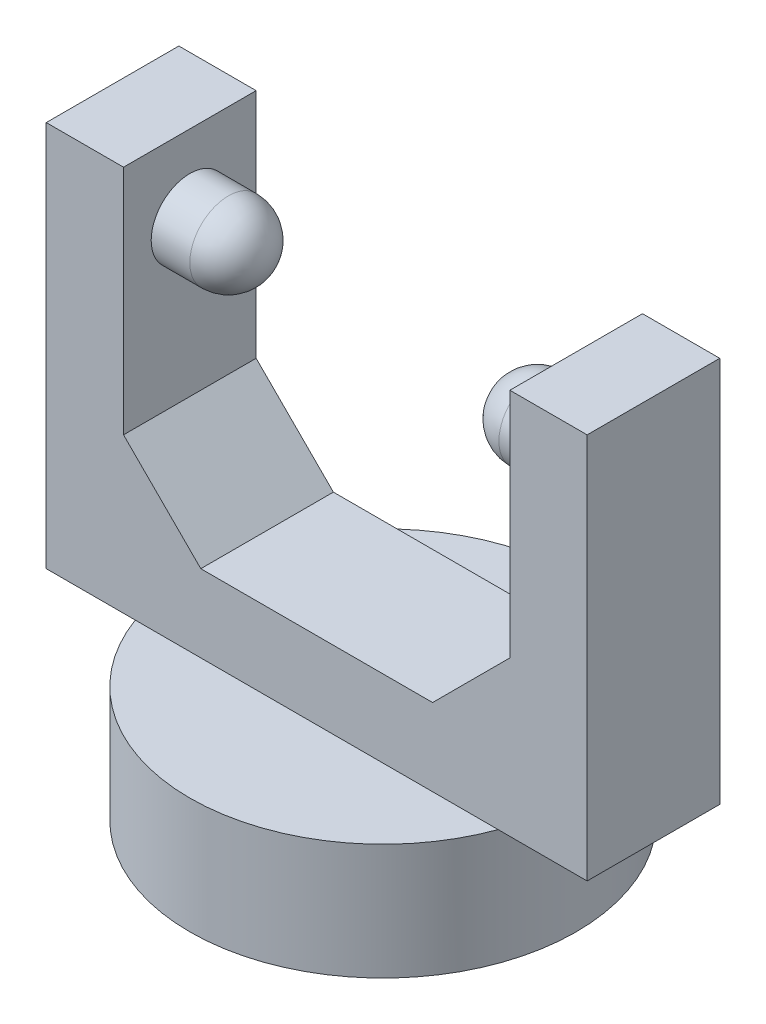
ISO-10303-21;
HEADER;
FILE_DESCRIPTION(('STEP AP214'),'2;1');
FILE_NAME('part.step','',(''),(''),'','','');
FILE_SCHEMA(('AUTOMOTIVE_DESIGN { 1 0 10303 214 1 1 1 1 }'));
ENDSEC;
DATA;
#1=APPLICATION_CONTEXT('core data for automotive mechanical design processes');
#2=APPLICATION_PROTOCOL_DEFINITION('international standard','automotive_design',2000,#1);
#3=PRODUCT_CONTEXT('',#1,'mechanical');
#4=PRODUCT('Part','Part','',(#3));
#5=PRODUCT_RELATED_PRODUCT_CATEGORY('part','',(#4));
#6=PRODUCT_DEFINITION_FORMATION('','',#4);
#7=PRODUCT_DEFINITION_CONTEXT('part definition',#1,'design');
#8=PRODUCT_DEFINITION('design','',#6,#7);
#9=PRODUCT_DEFINITION_SHAPE('','',#8);
#10=(LENGTH_UNIT() NAMED_UNIT(*) SI_UNIT(.MILLI.,.METRE.));
#11=(NAMED_UNIT(*) PLANE_ANGLE_UNIT() SI_UNIT($,.RADIAN.));
#12=(NAMED_UNIT(*) SI_UNIT($,.STERADIAN.) SOLID_ANGLE_UNIT());
#13=UNCERTAINTY_MEASURE_WITH_UNIT(LENGTH_MEASURE(1.E-05),#10,'distance_accuracy_value','');
#14=(GEOMETRIC_REPRESENTATION_CONTEXT(3) GLOBAL_UNCERTAINTY_ASSIGNED_CONTEXT((#13)) GLOBAL_UNIT_ASSIGNED_CONTEXT((#10,
#11,#12)) REPRESENTATION_CONTEXT('',''));
#15=CARTESIAN_POINT('',(0.,0.,0.));
#16=DIRECTION('',(0.,0.,1.));
#17=DIRECTION('',(1.,0.,0.));
#18=AXIS2_PLACEMENT_3D('',#15,#16,#17);
#19=CARTESIAN_POINT('',(0.,32.5,0.));
#20=DIRECTION('',(0.,1.,0.));
#21=DIRECTION('',(0.,0.,1.));
#22=AXIS2_PLACEMENT_3D('',#19,#20,#21);
#23=PLANE('',#22);
#24=DIRECTION('',(0.,0.,1.));
#25=VECTOR('',#24,1.);
#26=CARTESIAN_POINT('',(-12.5,32.5,-4.29038395748194));
#27=LINE('',#26,#25);
#28=CARTESIAN_POINT('',(-12.5,32.5,-4.29038395748194));
#29=VERTEX_POINT('',#28);
#30=CARTESIAN_POINT('',(-12.5,32.5,4.29038395748193));
#31=VERTEX_POINT('',#30);
#32=EDGE_CURVE('E143',#29,#31,#27,.T.);
#33=ORIENTED_EDGE('',*,*,#32,.F.);
#34=DIRECTION('',(-1.,0.,0.));
#35=VECTOR('',#34,1.);
#36=CARTESIAN_POINT('',(-17.5,32.5,-4.29038395748194));
#37=LINE('',#36,#35);
#38=CARTESIAN_POINT('',(-17.5,32.5,-4.29038395748194));
#39=VERTEX_POINT('',#38);
#40=EDGE_CURVE('E161',#29,#39,#37,.T.);
#41=ORIENTED_EDGE('',*,*,#40,.T.);
#42=DIRECTION('',(0.,0.,1.));
#43=VECTOR('',#42,1.);
#44=CARTESIAN_POINT('',(-17.5,32.5,-4.29038395748194));
#45=LINE('',#44,#43);
#46=CARTESIAN_POINT('',(-17.5,32.5,4.29038395748193));
#47=VERTEX_POINT('',#46);
#48=EDGE_CURVE('E153',#39,#47,#45,.T.);
#49=ORIENTED_EDGE('',*,*,#48,.T.);
#50=DIRECTION('',(1.,0.,0.));
#51=VECTOR('',#50,1.);
#52=CARTESIAN_POINT('',(-17.5,32.5,4.29038395748193));
#53=LINE('',#52,#51);
#54=EDGE_CURVE('E133',#47,#31,#53,.T.);
#55=ORIENTED_EDGE('',*,*,#54,.T.);
#56=EDGE_LOOP('',(#33,#41,#49,#55));
#57=FACE_BOUND('',#56,.T.);
#58=ADVANCED_FACE('F38',(#57),#23,.T.);
#59=CARTESIAN_POINT('',(0.,7.5,0.));
#60=DIRECTION('',(0.,1.,0.));
#61=DIRECTION('',(0.,0.,1.));
#62=AXIS2_PLACEMENT_3D('',#59,#60,#61);
#63=PLANE('',#62);
#64=DIRECTION('',(-1.,0.,0.));
#65=VECTOR('',#64,1.);
#66=CARTESIAN_POINT('',(-17.5,7.5,-4.29038395748194));
#67=LINE('',#66,#65);
#68=CARTESIAN_POINT('',(11.7406390583044,7.5,-4.29038395748194));
#69=VERTEX_POINT('',#68);
#70=CARTESIAN_POINT('',(-11.7406390583044,7.5,-4.29038395748194));
#71=VERTEX_POINT('',#70);
#72=EDGE_CURVE('E188',#69,#71,#67,.T.);
#73=ORIENTED_EDGE('',*,*,#72,.F.);
#74=CARTESIAN_POINT('',(0.,7.5,0.));
#75=DIRECTION('',(0.,1.,0.));
#76=DIRECTION('',(0.,0.,1.));
#77=AXIS2_PLACEMENT_3D('',#74,#75,#76);
#78=CIRCLE('',#77,12.5);
#79=EDGE_CURVE('E208',#69,#71,#78,.T.);
#80=ORIENTED_EDGE('',*,*,#79,.T.);
#81=EDGE_LOOP('',(#73,#80));
#82=FACE_BOUND('',#81,.T.);
#83=ADVANCED_FACE('F263',(#82),#63,.T.);
#84=CARTESIAN_POINT('',(0.,7.5,0.));
#85=DIRECTION('',(0.,-1.,0.));
#86=DIRECTION('',(0.,0.,-1.));
#87=AXIS2_PLACEMENT_3D('',#84,#85,#86);
#88=CYLINDRICAL_SURFACE('',#87,12.5);
#89=CARTESIAN_POINT('',(11.7406390583043,7.5,4.29038395748194));
#90=VERTEX_POINT('',#89);
#91=EDGE_CURVE('E204',#90,#69,#78,.T.);
#92=ORIENTED_EDGE('',*,*,#91,.F.);
#93=CARTESIAN_POINT('',(-11.7406390583044,7.5,4.29038395748193));
#94=VERTEX_POINT('',#93);
#95=EDGE_CURVE('E209',#94,#90,#78,.T.);
#96=ORIENTED_EDGE('',*,*,#95,.F.);
#97=EDGE_CURVE('E325',#71,#94,#78,.T.);
#98=ORIENTED_EDGE('',*,*,#97,.F.);
#99=ORIENTED_EDGE('',*,*,#79,.F.);
#100=EDGE_LOOP('',(#92,#96,#98,#99));
#101=FACE_BOUND('',#100,.T.);
#102=CARTESIAN_POINT('',(0.,0.,0.));
#103=DIRECTION('',(0.,1.,0.));
#104=DIRECTION('',(0.,0.,1.));
#105=AXIS2_PLACEMENT_3D('',#102,#103,#104);
#106=CIRCLE('',#105,12.5);
#107=CARTESIAN_POINT('',(0.,0.,12.5));
#108=VERTEX_POINT('',#107);
#109=EDGE_CURVE('E203',#108,#108,#106,.T.);
#110=ORIENTED_EDGE('',*,*,#109,.T.);
#111=EDGE_LOOP('',(#110));
#112=FACE_BOUND('',#111,.T.);
#113=ADVANCED_FACE('F269',(#101,#112),#88,.T.);
#114=DIRECTION('',(1.,0.,0.));
#115=VECTOR('',#114,1.);
#116=CARTESIAN_POINT('',(-17.5,7.5,4.29038395748193));
#117=LINE('',#116,#115);
#118=EDGE_CURVE('E180',#94,#90,#117,.T.);
#119=ORIENTED_EDGE('',*,*,#118,.F.);
#120=ORIENTED_EDGE('',*,*,#95,.T.);
#121=EDGE_LOOP('',(#119,#120));
#122=FACE_BOUND('',#121,.T.);
#123=ADVANCED_FACE('F272',(#122),#63,.T.);
#124=CARTESIAN_POINT('',(0.,0.,0.));
#125=DIRECTION('',(0.,1.,0.));
#126=DIRECTION('',(0.,0.,1.));
#127=AXIS2_PLACEMENT_3D('',#124,#125,#126);
#128=PLANE('',#127);
#129=ORIENTED_EDGE('',*,*,#109,.F.);
#130=EDGE_LOOP('',(#129));
#131=FACE_BOUND('',#130,.T.);
#132=ADVANCED_FACE('F348',(#131),#128,.F.);
#133=CARTESIAN_POINT('',(0.,7.5,0.));
#134=DIRECTION('',(0.,1.,0.));
#135=DIRECTION('',(0.,0.,1.));
#136=AXIS2_PLACEMENT_3D('',#133,#134,#135);
#137=PLANE('',#136);
#138=CARTESIAN_POINT('',(17.5,7.5,4.29038395748194));
#139=VERTEX_POINT('',#138);
#140=EDGE_CURVE('E174',#90,#139,#117,.T.);
#141=ORIENTED_EDGE('',*,*,#140,.F.);
#142=ORIENTED_EDGE('',*,*,#91,.T.);
#143=CARTESIAN_POINT('',(17.5,7.5,-4.29038395748194));
#144=VERTEX_POINT('',#143);
#145=EDGE_CURVE('E184',#144,#69,#67,.T.);
#146=ORIENTED_EDGE('',*,*,#145,.F.);
#147=DIRECTION('',(0.,0.,-1.));
#148=VECTOR('',#147,1.);
#149=CARTESIAN_POINT('',(17.5,7.5,-4.29038395748194));
#150=LINE('',#149,#148);
#151=EDGE_CURVE('E179',#139,#144,#150,.T.);
#152=ORIENTED_EDGE('',*,*,#151,.F.);
#153=EDGE_LOOP('',(#141,#142,#146,#152));
#154=FACE_BOUND('',#153,.T.);
#155=ADVANCED_FACE('F345',(#154),#137,.F.);
#156=CARTESIAN_POINT('',(-17.5,7.5,-4.29038395748194));
#157=VERTEX_POINT('',#156);
#158=EDGE_CURVE('E183',#71,#157,#67,.T.);
#159=ORIENTED_EDGE('',*,*,#158,.F.);
#160=ORIENTED_EDGE('',*,*,#97,.T.);
#161=CARTESIAN_POINT('',(-17.5,7.5,4.29038395748193));
#162=VERTEX_POINT('',#161);
#163=EDGE_CURVE('E175',#162,#94,#117,.T.);
#164=ORIENTED_EDGE('',*,*,#163,.F.);
#165=DIRECTION('',(0.,0.,1.));
#166=VECTOR('',#165,1.);
#167=CARTESIAN_POINT('',(-17.5,7.5,-4.29038395748194));
#168=LINE('',#167,#166);
#169=EDGE_CURVE('E170',#157,#162,#168,.T.);
#170=ORIENTED_EDGE('',*,*,#169,.F.);
#171=EDGE_LOOP('',(#159,#160,#164,#170));
#172=FACE_BOUND('',#171,.T.);
#173=ADVANCED_FACE('F338',(#172),#137,.F.);
#174=CARTESIAN_POINT('',(-17.5,32.5,-4.29038395748194));
#175=DIRECTION('',(1.,0.,0.));
#176=DIRECTION('',(0.,0.,-1.));
#177=AXIS2_PLACEMENT_3D('',#174,#175,#176);
#178=PLANE('',#177);
#179=ORIENTED_EDGE('',*,*,#169,.T.);
#180=DIRECTION('',(0.,-1.,0.));
#181=VECTOR('',#180,1.);
#182=CARTESIAN_POINT('',(-17.5,32.5,4.29038395748193));
#183=LINE('',#182,#181);
#184=EDGE_CURVE('E200',#47,#162,#183,.T.);
#185=ORIENTED_EDGE('',*,*,#184,.F.);
#186=ORIENTED_EDGE('',*,*,#48,.F.);
#187=DIRECTION('',(0.,-1.,0.));
#188=VECTOR('',#187,1.);
#189=CARTESIAN_POINT('',(-17.5,32.5,-4.29038395748194));
#190=LINE('',#189,#188);
#191=EDGE_CURVE('E169',#39,#157,#190,.T.);
#192=ORIENTED_EDGE('',*,*,#191,.T.);
#193=EDGE_LOOP('',(#179,#185,#186,#192));
#194=FACE_BOUND('',#193,.T.);
#195=ADVANCED_FACE('F337',(#194),#178,.F.);
#196=CARTESIAN_POINT('',(-17.5,32.5,4.29038395748193));
#197=DIRECTION('',(0.,0.,-1.));
#198=DIRECTION('',(-1.,0.,0.));
#199=AXIS2_PLACEMENT_3D('',#196,#197,#198);
#200=PLANE('',#199);
#201=DIRECTION('',(1.,0.,0.));
#202=VECTOR('',#201,1.);
#203=CARTESIAN_POINT('',(-12.5,12.5,4.29038395748193));
#204=LINE('',#203,#202);
#205=CARTESIAN_POINT('',(-7.49999999999997,12.5,4.29038395748193));
#206=VERTEX_POINT('',#205);
#207=CARTESIAN_POINT('',(7.49999999999997,12.5,4.29038395748193));
#208=VERTEX_POINT('',#207);
#209=EDGE_CURVE('E292',#206,#208,#204,.T.);
#210=ORIENTED_EDGE('',*,*,#209,.F.);
#211=DIRECTION('',(-0.707106781186551,0.707106781186544,0.));
#212=VECTOR('',#211,1.);
#213=CARTESIAN_POINT('',(-22.5,27.4999999999999,4.29038395748193));
#214=LINE('',#213,#212);
#215=CARTESIAN_POINT('',(-12.5,17.5,4.29038395748193));
#216=VERTEX_POINT('',#215);
#217=EDGE_CURVE('E135',#206,#216,#214,.T.);
#218=ORIENTED_EDGE('',*,*,#217,.T.);
#219=DIRECTION('',(0.,1.,0.));
#220=VECTOR('',#219,1.);
#221=CARTESIAN_POINT('',(-12.5,12.5,4.29038395748193));
#222=LINE('',#221,#220);
#223=EDGE_CURVE('E127',#216,#31,#222,.T.);
#224=ORIENTED_EDGE('',*,*,#223,.T.);
#225=ORIENTED_EDGE('',*,*,#54,.F.);
#226=ORIENTED_EDGE('',*,*,#184,.T.);
#227=ORIENTED_EDGE('',*,*,#163,.T.);
#228=ORIENTED_EDGE('',*,*,#118,.T.);
#229=ORIENTED_EDGE('',*,*,#140,.T.);
#230=DIRECTION('',(0.,-1.,0.));
#231=VECTOR('',#230,1.);
#232=CARTESIAN_POINT('',(17.5,32.5,4.29038395748194));
#233=LINE('',#232,#231);
#234=CARTESIAN_POINT('',(17.5,32.5,4.29038395748194));
#235=VERTEX_POINT('',#234);
#236=EDGE_CURVE('E196',#235,#139,#233,.T.);
#237=ORIENTED_EDGE('',*,*,#236,.F.);
#238=CARTESIAN_POINT('',(12.5,32.5,4.29038395748194));
#239=VERTEX_POINT('',#238);
#240=EDGE_CURVE('E157',#239,#235,#53,.T.);
#241=ORIENTED_EDGE('',*,*,#240,.F.);
#242=DIRECTION('',(0.,1.,0.));
#243=VECTOR('',#242,1.);
#244=CARTESIAN_POINT('',(12.5,12.5,4.29038395748193));
#245=LINE('',#244,#243);
#246=CARTESIAN_POINT('',(12.5,17.5,4.29038395748193));
#247=VERTEX_POINT('',#246);
#248=EDGE_CURVE('E139',#247,#239,#245,.T.);
#249=ORIENTED_EDGE('',*,*,#248,.F.);
#250=DIRECTION('',(-0.707106781186551,-0.707106781186544,0.));
#251=VECTOR('',#250,1.);
#252=CARTESIAN_POINT('',(4.99999999999987,9.99999999999991,4.29038395748193));
#253=LINE('',#252,#251);
#254=EDGE_CURVE('E242',#247,#208,#253,.T.);
#255=ORIENTED_EDGE('',*,*,#254,.T.);
#256=EDGE_LOOP('',(#210,#218,#224,#225,#226,#227,#228,#229,#237,#241,#249,#255));
#257=FACE_BOUND('',#256,.T.);
#258=ADVANCED_FACE('F130',(#257),#200,.F.);
#259=CARTESIAN_POINT('',(17.5,32.5,-4.29038395748194));
#260=DIRECTION('',(-1.,0.,0.));
#261=DIRECTION('',(0.,0.,1.));
#262=AXIS2_PLACEMENT_3D('',#259,#260,#261);
#263=PLANE('',#262);
#264=ORIENTED_EDGE('',*,*,#151,.T.);
#265=DIRECTION('',(0.,-1.,0.));
#266=VECTOR('',#265,1.);
#267=CARTESIAN_POINT('',(17.5,32.5,-4.29038395748194));
#268=LINE('',#267,#266);
#269=CARTESIAN_POINT('',(17.5,32.5,-4.29038395748194));
#270=VERTEX_POINT('',#269);
#271=EDGE_CURVE('E192',#270,#144,#268,.T.);
#272=ORIENTED_EDGE('',*,*,#271,.F.);
#273=DIRECTION('',(0.,0.,-1.));
#274=VECTOR('',#273,1.);
#275=CARTESIAN_POINT('',(17.5,32.5,-4.29038395748194));
#276=LINE('',#275,#274);
#277=EDGE_CURVE('E156',#235,#270,#276,.T.);
#278=ORIENTED_EDGE('',*,*,#277,.F.);
#279=ORIENTED_EDGE('',*,*,#236,.T.);
#280=EDGE_LOOP('',(#264,#272,#278,#279));
#281=FACE_BOUND('',#280,.T.);
#282=ADVANCED_FACE('F284',(#281),#263,.F.);
#283=CARTESIAN_POINT('',(-17.5,32.5,-4.29038395748194));
#284=DIRECTION('',(0.,0.,1.));
#285=DIRECTION('',(1.,0.,0.));
#286=AXIS2_PLACEMENT_3D('',#283,#284,#285);
#287=PLANE('',#286);
#288=ORIENTED_EDGE('',*,*,#40,.F.);
#289=DIRECTION('',(0.,1.,0.));
#290=VECTOR('',#289,1.);
#291=CARTESIAN_POINT('',(-12.5,12.5,-4.29038395748194));
#292=LINE('',#291,#290);
#293=CARTESIAN_POINT('',(-12.5,17.5,-4.29038395748194));
#294=VERTEX_POINT('',#293);
#295=EDGE_CURVE('E146',#294,#29,#292,.T.);
#296=ORIENTED_EDGE('',*,*,#295,.F.);
#297=DIRECTION('',(0.707106781186551,-0.707106781186544,0.));
#298=VECTOR('',#297,1.);
#299=CARTESIAN_POINT('',(-22.5,27.4999999999999,-4.29038395748194));
#300=LINE('',#299,#298);
#301=CARTESIAN_POINT('',(-7.49999999999997,12.5,-4.29038395748194));
#302=VERTEX_POINT('',#301);
#303=EDGE_CURVE('E230',#294,#302,#300,.T.);
#304=ORIENTED_EDGE('',*,*,#303,.T.);
#305=DIRECTION('',(-1.,0.,0.));
#306=VECTOR('',#305,1.);
#307=CARTESIAN_POINT('',(-12.5,12.5,-4.29038395748194));
#308=LINE('',#307,#306);
#309=CARTESIAN_POINT('',(7.49999999999996,12.5,-4.29038395748194));
#310=VERTEX_POINT('',#309);
#311=EDGE_CURVE('E140',#310,#302,#308,.T.);
#312=ORIENTED_EDGE('',*,*,#311,.F.);
#313=DIRECTION('',(0.707106781186551,0.707106781186544,0.));
#314=VECTOR('',#313,1.);
#315=CARTESIAN_POINT('',(4.99999999999987,9.99999999999991,-4.29038395748194));
#316=LINE('',#315,#314);
#317=CARTESIAN_POINT('',(12.5,17.5,-4.29038395748194));
#318=VERTEX_POINT('',#317);
#319=EDGE_CURVE('E62',#310,#318,#316,.T.);
#320=ORIENTED_EDGE('',*,*,#319,.T.);
#321=DIRECTION('',(0.,1.,0.));
#322=VECTOR('',#321,1.);
#323=CARTESIAN_POINT('',(12.5,12.5,-4.29038395748194));
#324=LINE('',#323,#322);
#325=CARTESIAN_POINT('',(12.5,32.5,-4.29038395748194));
#326=VERTEX_POINT('',#325);
#327=EDGE_CURVE('E302',#318,#326,#324,.T.);
#328=ORIENTED_EDGE('',*,*,#327,.T.);
#329=EDGE_CURVE('E165',#270,#326,#37,.T.);
#330=ORIENTED_EDGE('',*,*,#329,.F.);
#331=ORIENTED_EDGE('',*,*,#271,.T.);
#332=ORIENTED_EDGE('',*,*,#145,.T.);
#333=ORIENTED_EDGE('',*,*,#72,.T.);
#334=ORIENTED_EDGE('',*,*,#158,.T.);
#335=ORIENTED_EDGE('',*,*,#191,.F.);
#336=EDGE_LOOP('',(#288,#296,#304,#312,#320,#328,#330,#331,#332,#333,#334,#335));
#337=FACE_BOUND('',#336,.T.);
#338=ADVANCED_FACE('F276',(#337),#287,.F.);
#339=DIRECTION('',(0.,0.,-1.));
#340=VECTOR('',#339,1.);
#341=CARTESIAN_POINT('',(12.5,32.5,-4.29038395748194));
#342=LINE('',#341,#340);
#343=EDGE_CURVE('E150',#239,#326,#342,.T.);
#344=ORIENTED_EDGE('',*,*,#343,.F.);
#345=ORIENTED_EDGE('',*,*,#240,.T.);
#346=ORIENTED_EDGE('',*,*,#277,.T.);
#347=ORIENTED_EDGE('',*,*,#329,.T.);
#348=EDGE_LOOP('',(#344,#345,#346,#347));
#349=FACE_BOUND('',#348,.T.);
#350=ADVANCED_FACE('F265',(#349),#23,.T.);
#351=CARTESIAN_POINT('',(-12.5,12.5,-4.29038395748194));
#352=DIRECTION('',(-1.,0.,0.));
#353=DIRECTION('',(0.,0.,1.));
#354=AXIS2_PLACEMENT_3D('',#351,#352,#353);
#355=PLANE('',#354);
#356=CARTESIAN_POINT('',(-12.5,27.5,0.));
#357=DIRECTION('',(-1.,0.,0.));
#358=DIRECTION('',(0.,0.,1.));
#359=AXIS2_PLACEMENT_3D('',#356,#357,#358);
#360=CIRCLE('',#359,2.5);
#361=CARTESIAN_POINT('',(-12.5,27.5,2.5));
#362=VERTEX_POINT('',#361);
#363=EDGE_CURVE('E213',#362,#362,#360,.F.);
#364=ORIENTED_EDGE('',*,*,#363,.F.);
#365=EDGE_LOOP('',(#364));
#366=FACE_BOUND('',#365,.T.);
#367=ORIENTED_EDGE('',*,*,#223,.F.);
#368=DIRECTION('',(0.,0.,-1.));
#369=VECTOR('',#368,1.);
#370=CARTESIAN_POINT('',(-12.5,17.5,-4.29038395748194));
#371=LINE('',#370,#369);
#372=EDGE_CURVE('E225',#216,#294,#371,.T.);
#373=ORIENTED_EDGE('',*,*,#372,.T.);
#374=ORIENTED_EDGE('',*,*,#295,.T.);
#375=ORIENTED_EDGE('',*,*,#32,.T.);
#376=EDGE_LOOP('',(#367,#373,#374,#375));
#377=FACE_BOUND('',#376,.T.);
#378=ADVANCED_FACE('F144',(#366,#377),#355,.F.);
#379=CARTESIAN_POINT('',(12.5,12.5,-4.29038395748194));
#380=DIRECTION('',(1.,0.,0.));
#381=DIRECTION('',(0.,0.,-1.));
#382=AXIS2_PLACEMENT_3D('',#379,#380,#381);
#383=PLANE('',#382);
#384=CARTESIAN_POINT('',(12.5,27.5,0.));
#385=DIRECTION('',(1.,0.,0.));
#386=DIRECTION('',(0.,0.,-1.));
#387=AXIS2_PLACEMENT_3D('',#384,#385,#386);
#388=CIRCLE('',#387,2.5);
#389=CARTESIAN_POINT('',(12.5,27.5,-2.5));
#390=VERTEX_POINT('',#389);
#391=EDGE_CURVE('E217',#390,#390,#388,.F.);
#392=ORIENTED_EDGE('',*,*,#391,.F.);
#393=EDGE_LOOP('',(#392));
#394=FACE_BOUND('',#393,.T.);
#395=ORIENTED_EDGE('',*,*,#327,.F.);
#396=DIRECTION('',(0.,0.,1.));
#397=VECTOR('',#396,1.);
#398=CARTESIAN_POINT('',(12.5,17.5,-4.29038395748194));
#399=LINE('',#398,#397);
#400=EDGE_CURVE('E54',#318,#247,#399,.T.);
#401=ORIENTED_EDGE('',*,*,#400,.T.);
#402=ORIENTED_EDGE('',*,*,#248,.T.);
#403=ORIENTED_EDGE('',*,*,#343,.T.);
#404=EDGE_LOOP('',(#395,#401,#402,#403));
#405=FACE_BOUND('',#404,.T.);
#406=ADVANCED_FACE('F282',(#394,#405),#383,.F.);
#407=CARTESIAN_POINT('',(0.,12.5,0.));
#408=DIRECTION('',(0.,1.,0.));
#409=DIRECTION('',(0.,0.,1.));
#410=AXIS2_PLACEMENT_3D('',#407,#408,#409);
#411=PLANE('',#410);
#412=ORIENTED_EDGE('',*,*,#209,.T.);
#413=DIRECTION('',(0.,0.,-1.));
#414=VECTOR('',#413,1.);
#415=CARTESIAN_POINT('',(7.49999999999997,12.5,0.));
#416=LINE('',#415,#414);
#417=EDGE_CURVE('E234',#208,#310,#416,.T.);
#418=ORIENTED_EDGE('',*,*,#417,.T.);
#419=ORIENTED_EDGE('',*,*,#311,.T.);
#420=DIRECTION('',(0.,0.,1.));
#421=VECTOR('',#420,1.);
#422=CARTESIAN_POINT('',(-7.49999999999997,12.5,0.));
#423=LINE('',#422,#421);
#424=EDGE_CURVE('E221',#302,#206,#423,.T.);
#425=ORIENTED_EDGE('',*,*,#424,.T.);
#426=EDGE_LOOP('',(#412,#418,#419,#425));
#427=FACE_BOUND('',#426,.T.);
#428=ADVANCED_FACE('F316',(#427),#411,.T.);
#429=CARTESIAN_POINT('',(-7.5,27.5,0.));
#430=DIRECTION('',(-1.,0.,0.));
#431=DIRECTION('',(0.,0.,1.));
#432=AXIS2_PLACEMENT_3D('',#429,#430,#431);
#433=CYLINDRICAL_SURFACE('',#432,2.5);
#434=CARTESIAN_POINT('',(-10.,27.5,0.));
#435=DIRECTION('',(-1.,0.,0.));
#436=DIRECTION('',(0.,0.,1.));
#437=AXIS2_PLACEMENT_3D('',#434,#435,#436);
#438=CIRCLE('',#437,2.5);
#439=CARTESIAN_POINT('',(-10.,27.5,2.5));
#440=VERTEX_POINT('',#439);
#441=EDGE_CURVE('E47',#440,#440,#438,.T.);
#442=ORIENTED_EDGE('',*,*,#441,.T.);
#443=EDGE_LOOP('',(#442));
#444=FACE_BOUND('',#443,.T.);
#445=ORIENTED_EDGE('',*,*,#363,.T.);
#446=EDGE_LOOP('',(#445));
#447=FACE_BOUND('',#446,.T.);
#448=ADVANCED_FACE('F248',(#444,#447),#433,.T.);
#449=CARTESIAN_POINT('',(7.5,27.5,0.));
#450=DIRECTION('',(1.,0.,0.));
#451=DIRECTION('',(0.,0.,-1.));
#452=AXIS2_PLACEMENT_3D('',#449,#450,#451);
#453=CYLINDRICAL_SURFACE('',#452,2.5);
#454=CARTESIAN_POINT('',(10.,27.5,0.));
#455=DIRECTION('',(1.,0.,0.));
#456=DIRECTION('',(0.,0.,-1.));
#457=AXIS2_PLACEMENT_3D('',#454,#455,#456);
#458=CIRCLE('',#457,2.5);
#459=CARTESIAN_POINT('',(10.,27.5,-2.5));
#460=VERTEX_POINT('',#459);
#461=EDGE_CURVE('E11',#460,#460,#458,.T.);
#462=ORIENTED_EDGE('',*,*,#461,.T.);
#463=EDGE_LOOP('',(#462));
#464=FACE_BOUND('',#463,.T.);
#465=ORIENTED_EDGE('',*,*,#391,.T.);
#466=EDGE_LOOP('',(#465));
#467=FACE_BOUND('',#466,.T.);
#468=ADVANCED_FACE('F366',(#464,#467),#453,.T.);
#469=CARTESIAN_POINT('',(-7.49999999999997,12.5,0.));
#470=DIRECTION('',(-0.707106781186544,-0.707106781186551,0.));
#471=DIRECTION('',(0.,0.,1.));
#472=AXIS2_PLACEMENT_3D('',#469,#470,#471);
#473=PLANE('',#472);
#474=ORIENTED_EDGE('',*,*,#303,.F.);
#475=ORIENTED_EDGE('',*,*,#372,.F.);
#476=ORIENTED_EDGE('',*,*,#217,.F.);
#477=ORIENTED_EDGE('',*,*,#424,.F.);
#478=EDGE_LOOP('',(#474,#475,#476,#477));
#479=FACE_BOUND('',#478,.T.);
#480=ADVANCED_FACE('F259',(#479),#473,.F.);
#481=CARTESIAN_POINT('',(7.49999999999997,12.5,0.));
#482=DIRECTION('',(0.707106781186544,-0.707106781186551,0.));
#483=DIRECTION('',(0.,0.,-1.));
#484=AXIS2_PLACEMENT_3D('',#481,#482,#483);
#485=PLANE('',#484);
#486=ORIENTED_EDGE('',*,*,#254,.F.);
#487=ORIENTED_EDGE('',*,*,#400,.F.);
#488=ORIENTED_EDGE('',*,*,#319,.F.);
#489=ORIENTED_EDGE('',*,*,#417,.F.);
#490=EDGE_LOOP('',(#486,#487,#488,#489));
#491=FACE_BOUND('',#490,.T.);
#492=ADVANCED_FACE('F253',(#491),#485,.F.);
#493=CARTESIAN_POINT('',(-10.,27.5,0.));
#494=DIRECTION('',(1.,0.,0.));
#495=DIRECTION('',(0.,0.,-1.));
#496=AXIS2_PLACEMENT_3D('',#493,#494,#495);
#497=SPHERICAL_SURFACE('',#496,2.5);
#498=ORIENTED_EDGE('',*,*,#441,.F.);
#499=EDGE_LOOP('',(#498));
#500=FACE_BOUND('',#499,.T.);
#501=ADVANCED_FACE('F251',(#500),#497,.T.);
#502=CARTESIAN_POINT('',(10.,27.5,0.));
#503=DIRECTION('',(-1.,0.,0.));
#504=DIRECTION('',(0.,0.,1.));
#505=AXIS2_PLACEMENT_3D('',#502,#503,#504);
#506=SPHERICAL_SURFACE('',#505,2.5);
#507=ORIENTED_EDGE('',*,*,#461,.F.);
#508=EDGE_LOOP('',(#507));
#509=FACE_BOUND('',#508,.T.);
#510=ADVANCED_FACE('F40',(#509),#506,.T.);
#511=CLOSED_SHELL('',(#58,#83,#113,#123,#132,#155,#173,#195,#258,#282,#338,#350,#378,#406,#428,
#448,#468,#480,#492,#501,#510));
#512=MANIFOLD_SOLID_BREP('B2',#511);
#513=ADVANCED_BREP_SHAPE_REPRESENTATION('',(#18,#512),#14);
#514=SHAPE_DEFINITION_REPRESENTATION(#9,#513);
ENDSEC;
END-ISO-10303-21;
